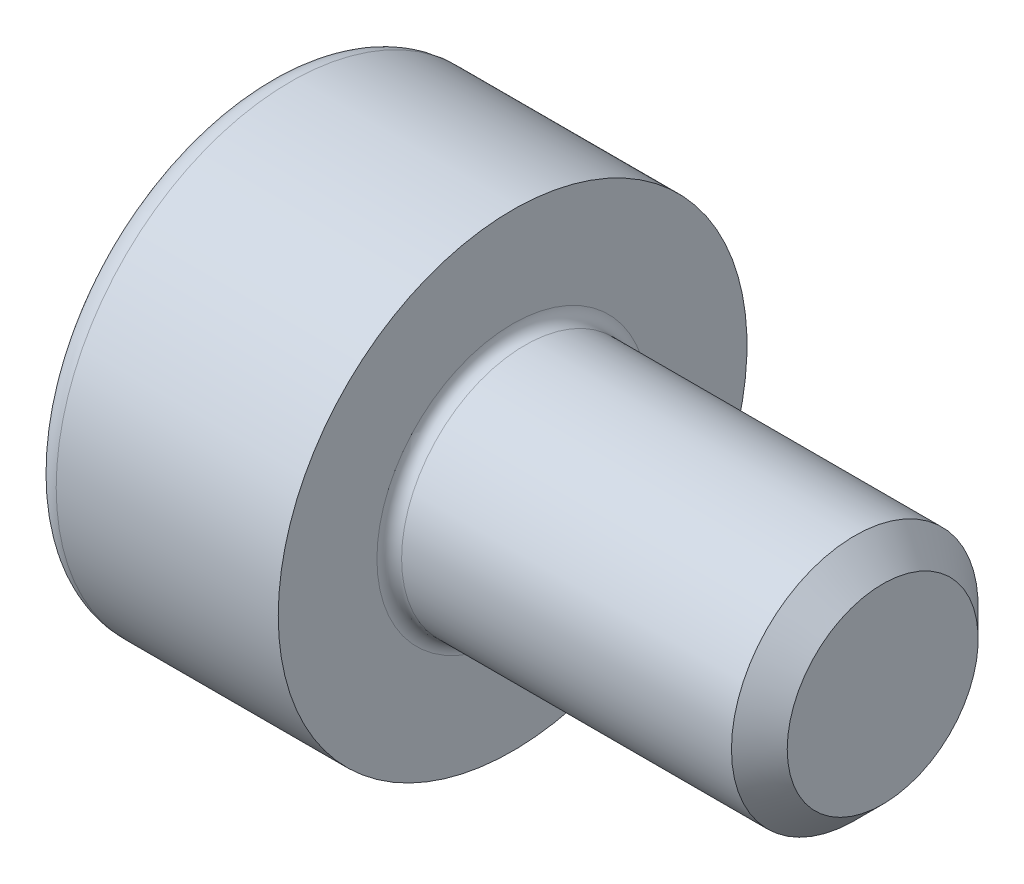
ISO-10303-21;
HEADER;
FILE_DESCRIPTION(('STEP AP214'),'2;1');
FILE_NAME('part.step','',(''),(''),'','','');
FILE_SCHEMA(('AUTOMOTIVE_DESIGN { 1 0 10303 214 1 1 1 1 }'));
ENDSEC;
DATA;
#1=APPLICATION_CONTEXT('core data for automotive mechanical design processes');
#2=APPLICATION_PROTOCOL_DEFINITION('international standard','automotive_design',2000,#1);
#3=PRODUCT_CONTEXT('',#1,'mechanical');
#4=PRODUCT('Part','Part','',(#3));
#5=PRODUCT_RELATED_PRODUCT_CATEGORY('part','',(#4));
#6=PRODUCT_DEFINITION_FORMATION('','',#4);
#7=PRODUCT_DEFINITION_CONTEXT('part definition',#1,'design');
#8=PRODUCT_DEFINITION('design','',#6,#7);
#9=PRODUCT_DEFINITION_SHAPE('','',#8);
#10=(LENGTH_UNIT() NAMED_UNIT(*) SI_UNIT(.MILLI.,.METRE.));
#11=(NAMED_UNIT(*) PLANE_ANGLE_UNIT() SI_UNIT($,.RADIAN.));
#12=(NAMED_UNIT(*) SI_UNIT($,.STERADIAN.) SOLID_ANGLE_UNIT());
#13=UNCERTAINTY_MEASURE_WITH_UNIT(LENGTH_MEASURE(1.E-05),#10,'distance_accuracy_value','');
#14=(GEOMETRIC_REPRESENTATION_CONTEXT(3) GLOBAL_UNCERTAINTY_ASSIGNED_CONTEXT((#13)) GLOBAL_UNIT_ASSIGNED_CONTEXT((#10,
#11,#12)) REPRESENTATION_CONTEXT('',''));
#15=CARTESIAN_POINT('',(0.,0.,0.));
#16=DIRECTION('',(0.,0.,1.));
#17=DIRECTION('',(1.,0.,0.));
#18=AXIS2_PLACEMENT_3D('',#15,#16,#17);
#19=CARTESIAN_POINT('',(5.,0.774,0.));
#20=DIRECTION('',(1.,0.,0.));
#21=DIRECTION('',(0.,0.,-1.));
#22=AXIS2_PLACEMENT_3D('',#19,#20,#21);
#23=PLANE('',#22);
#24=CARTESIAN_POINT('',(4.99999999993861,0.,0.));
#25=DIRECTION('',(-1.,0.,0.));
#26=DIRECTION('',(0.,0.,1.));
#27=AXIS2_PLACEMENT_3D('',#24,#25,#26);
#28=CIRCLE('',#27,0.773999999978514);
#29=CARTESIAN_POINT('',(4.99999999993861,0.,0.773999999978514));
#30=VERTEX_POINT('',#29);
#31=EDGE_CURVE('E107',#30,#30,#28,.T.);
#32=ORIENTED_EDGE('',*,*,#31,.F.);
#33=EDGE_LOOP('',(#32));
#34=FACE_BOUND('',#33,.T.);
#35=ADVANCED_FACE('F16',(#34),#23,.T.);
#36=CARTESIAN_POINT('',(0.999999999976353,0.,0.));
#37=DIRECTION('',(-1.,0.,0.));
#38=DIRECTION('',(0.,0.,1.));
#39=AXIS2_PLACEMENT_3D('',#36,#37,#38);
#40=CONICAL_SURFACE('',#39,0.760000000013861,1.04719755119142);
#41=CARTESIAN_POINT('',(1.43878620457372,0.,0.));
#42=VERTEX_POINT('',#41);
#43=VERTEX_LOOP('',#42);
#44=FACE_BOUND('',#43,.T.);
#45=CARTESIAN_POINT('',(0.999999999976353,0.,0.));
#46=DIRECTION('',(-1.,0.,0.));
#47=DIRECTION('',(0.,0.,1.));
#48=AXIS2_PLACEMENT_3D('',#45,#46,#47);
#49=CIRCLE('',#48,0.760000000013861);
#50=CARTESIAN_POINT('',(0.999999999988177,-0.658179306882177,0.380000000003467));
#51=VERTEX_POINT('',#50);
#52=CARTESIAN_POINT('',(0.999999999988177,0.,0.76000000000693));
#53=VERTEX_POINT('',#52);
#54=EDGE_CURVE('E96',#51,#53,#49,.T.);
#55=ORIENTED_EDGE('',*,*,#54,.T.);
#56=CARTESIAN_POINT('',(0.999999999976353,0.,0.));
#57=DIRECTION('',(-1.,0.,0.));
#58=DIRECTION('',(0.,0.,1.));
#59=AXIS2_PLACEMENT_3D('',#56,#57,#58);
#60=CIRCLE('',#59,0.760000000013861);
#61=CARTESIAN_POINT('',(0.999999999988177,0.658179306882173,0.380000000003464));
#62=VERTEX_POINT('',#61);
#63=EDGE_CURVE('E99',#53,#62,#60,.T.);
#64=ORIENTED_EDGE('',*,*,#63,.T.);
#65=CARTESIAN_POINT('',(0.999999999976353,0.,0.));
#66=DIRECTION('',(-1.,0.,0.));
#67=DIRECTION('',(0.,0.,1.));
#68=AXIS2_PLACEMENT_3D('',#65,#66,#67);
#69=CIRCLE('',#68,0.760000000013861);
#70=CARTESIAN_POINT('',(0.999999999988177,0.658179306882173,-0.380000000003465));
#71=VERTEX_POINT('',#70);
#72=EDGE_CURVE('E102',#62,#71,#69,.T.);
#73=ORIENTED_EDGE('',*,*,#72,.T.);
#74=CARTESIAN_POINT('',(0.999999999976353,0.,0.));
#75=DIRECTION('',(-1.,0.,0.));
#76=DIRECTION('',(0.,0.,1.));
#77=AXIS2_PLACEMENT_3D('',#74,#75,#76);
#78=CIRCLE('',#77,0.760000000013861);
#79=CARTESIAN_POINT('',(0.999999999988177,2.50354045686177E-13,-0.760000000006931));
#80=VERTEX_POINT('',#79);
#81=EDGE_CURVE('E117',#71,#80,#78,.T.);
#82=ORIENTED_EDGE('',*,*,#81,.T.);
#83=CARTESIAN_POINT('',(0.999999999976353,0.,0.));
#84=DIRECTION('',(-1.,0.,0.));
#85=DIRECTION('',(0.,0.,1.));
#86=AXIS2_PLACEMENT_3D('',#83,#84,#85);
#87=CIRCLE('',#86,0.760000000013861);
#88=CARTESIAN_POINT('',(0.999999999988177,-0.658179306882178,-0.380000000003466));
#89=VERTEX_POINT('',#88);
#90=EDGE_CURVE('E118',#80,#89,#87,.T.);
#91=ORIENTED_EDGE('',*,*,#90,.T.);
#92=CARTESIAN_POINT('',(0.999999999976353,0.,0.));
#93=DIRECTION('',(-1.,0.,0.));
#94=DIRECTION('',(0.,0.,1.));
#95=AXIS2_PLACEMENT_3D('',#92,#93,#94);
#96=CIRCLE('',#95,0.760000000013861);
#97=EDGE_CURVE('E225',#89,#51,#96,.T.);
#98=ORIENTED_EDGE('',*,*,#97,.T.);
#99=EDGE_LOOP('',(#55,#64,#73,#82,#91,#98));
#100=FACE_BOUND('',#99,.T.);
#101=ADVANCED_FACE('F101',(#44,#100),#40,.F.);
#102=CARTESIAN_POINT('',(4.77399999994077,0.,0.));
#103=DIRECTION('',(-1.,0.,0.));
#104=DIRECTION('',(0.,0.,1.));
#105=AXIS2_PLACEMENT_3D('',#102,#103,#104);
#106=CONICAL_SURFACE('',#105,0.999999999976353,0.785398163397448);
#107=CARTESIAN_POINT('',(4.774,0.,0.));
#108=DIRECTION('',(-1.,0.,0.));
#109=DIRECTION('',(0.,0.,1.));
#110=AXIS2_PLACEMENT_3D('',#107,#108,#109);
#111=CIRCLE('',#110,1.);
#112=CARTESIAN_POINT('',(4.774,0.,1.));
#113=VERTEX_POINT('',#112);
#114=EDGE_CURVE('E132',#113,#113,#111,.T.);
#115=ORIENTED_EDGE('',*,*,#114,.F.);
#116=EDGE_LOOP('',(#115));
#117=FACE_BOUND('',#116,.T.);
#118=ORIENTED_EDGE('',*,*,#31,.T.);
#119=EDGE_LOOP('',(#118));
#120=FACE_BOUND('',#119,.T.);
#121=ADVANCED_FACE('F515',(#117,#120),#106,.T.);
#122=CARTESIAN_POINT('',(1.,0.877572409168226,0.));
#123=DIRECTION('',(1.,0.,0.));
#124=DIRECTION('',(0.,0.,-1.));
#125=AXIS2_PLACEMENT_3D('',#122,#123,#124);
#126=PLANE('',#125);
#127=DIRECTION('',(0.,0.5,-0.866025403784439));
#128=VECTOR('',#127,1.);
#129=CARTESIAN_POINT('',(1.,0.877572409168226,0.));
#130=LINE('',#129,#128);
#131=CARTESIAN_POINT('',(1.,0.43878620458411,0.759999999999999));
#132=VERTEX_POINT('',#131);
#133=EDGE_CURVE('E121',#62,#132,#130,.F.);
#134=ORIENTED_EDGE('',*,*,#133,.F.);
#135=ORIENTED_EDGE('',*,*,#63,.F.);
#136=DIRECTION('',(0.,-1.,0.));
#137=VECTOR('',#136,1.);
#138=CARTESIAN_POINT('',(1.,-0.438786204584121,0.76));
#139=LINE('',#138,#137);
#140=EDGE_CURVE('E123',#53,#132,#139,.F.);
#141=ORIENTED_EDGE('',*,*,#140,.T.);
#142=EDGE_LOOP('',(#134,#135,#141));
#143=FACE_BOUND('',#142,.T.);
#144=ADVANCED_FACE('F122',(#143),#126,.F.);
#145=CARTESIAN_POINT('',(1.,0.877572409168226,0.));
#146=DIRECTION('',(1.,0.,0.));
#147=DIRECTION('',(0.,0.,-1.));
#148=AXIS2_PLACEMENT_3D('',#145,#146,#147);
#149=PLANE('',#148);
#150=DIRECTION('',(0.,-1.,0.));
#151=VECTOR('',#150,1.);
#152=CARTESIAN_POINT('',(1.,-0.438786204584121,0.76));
#153=LINE('',#152,#151);
#154=CARTESIAN_POINT('',(1.,-0.438786204584121,0.76));
#155=VERTEX_POINT('',#154);
#156=EDGE_CURVE('E127',#155,#53,#153,.F.);
#157=ORIENTED_EDGE('',*,*,#156,.T.);
#158=ORIENTED_EDGE('',*,*,#54,.F.);
#159=DIRECTION('',(0.,0.500000000000001,0.866025403784438));
#160=VECTOR('',#159,1.);
#161=CARTESIAN_POINT('',(1.,-0.438786204584121,0.76));
#162=LINE('',#161,#160);
#163=EDGE_CURVE('E182',#155,#51,#162,.F.);
#164=ORIENTED_EDGE('',*,*,#163,.F.);
#165=EDGE_LOOP('',(#157,#158,#164));
#166=FACE_BOUND('',#165,.T.);
#167=ADVANCED_FACE('F371',(#166),#149,.F.);
#168=CARTESIAN_POINT('',(1.,0.877572409168226,0.));
#169=DIRECTION('',(1.,0.,0.));
#170=DIRECTION('',(0.,0.,-1.));
#171=AXIS2_PLACEMENT_3D('',#168,#169,#170);
#172=PLANE('',#171);
#173=DIRECTION('',(0.,0.500000000000001,0.866025403784438));
#174=VECTOR('',#173,1.);
#175=CARTESIAN_POINT('',(1.,-0.438786204584121,0.76));
#176=LINE('',#175,#174);
#177=CARTESIAN_POINT('',(1.,-0.877572409168238,0.));
#178=VERTEX_POINT('',#177);
#179=EDGE_CURVE('E178',#51,#178,#176,.F.);
#180=ORIENTED_EDGE('',*,*,#179,.F.);
#181=ORIENTED_EDGE('',*,*,#97,.F.);
#182=DIRECTION('',(0.,-0.5,0.866025403784439));
#183=VECTOR('',#182,1.);
#184=CARTESIAN_POINT('',(1.,-0.877572409168238,0.));
#185=LINE('',#184,#183);
#186=EDGE_CURVE('E164',#178,#89,#185,.F.);
#187=ORIENTED_EDGE('',*,*,#186,.F.);
#188=EDGE_LOOP('',(#180,#181,#187));
#189=FACE_BOUND('',#188,.T.);
#190=ADVANCED_FACE('F366',(#189),#172,.F.);
#191=CARTESIAN_POINT('',(1.,0.877572409168226,0.));
#192=DIRECTION('',(1.,0.,0.));
#193=DIRECTION('',(0.,0.,-1.));
#194=AXIS2_PLACEMENT_3D('',#191,#192,#193);
#195=PLANE('',#194);
#196=DIRECTION('',(0.,-0.5,0.866025403784439));
#197=VECTOR('',#196,1.);
#198=CARTESIAN_POINT('',(1.,-0.877572409168238,0.));
#199=LINE('',#198,#197);
#200=CARTESIAN_POINT('',(1.,-0.438786204584122,-0.76));
#201=VERTEX_POINT('',#200);
#202=EDGE_CURVE('E161',#89,#201,#199,.F.);
#203=ORIENTED_EDGE('',*,*,#202,.F.);
#204=ORIENTED_EDGE('',*,*,#90,.F.);
#205=DIRECTION('',(0.,1.,0.));
#206=VECTOR('',#205,1.);
#207=CARTESIAN_POINT('',(1.,0.438786204584109,-0.760000000000001));
#208=LINE('',#207,#206);
#209=EDGE_CURVE('E155',#80,#201,#208,.F.);
#210=ORIENTED_EDGE('',*,*,#209,.T.);
#211=EDGE_LOOP('',(#203,#204,#210));
#212=FACE_BOUND('',#211,.T.);
#213=ADVANCED_FACE('F361',(#212),#195,.F.);
#214=CARTESIAN_POINT('',(1.,0.877572409168226,0.));
#215=DIRECTION('',(1.,0.,0.));
#216=DIRECTION('',(0.,0.,-1.));
#217=AXIS2_PLACEMENT_3D('',#214,#215,#216);
#218=PLANE('',#217);
#219=DIRECTION('',(0.,0.500000000000001,0.866025403784438));
#220=VECTOR('',#219,1.);
#221=CARTESIAN_POINT('',(1.,0.877572409168226,0.));
#222=LINE('',#221,#220);
#223=CARTESIAN_POINT('',(1.,0.877572409168226,0.));
#224=VERTEX_POINT('',#223);
#225=EDGE_CURVE('E115',#224,#71,#222,.F.);
#226=ORIENTED_EDGE('',*,*,#225,.T.);
#227=ORIENTED_EDGE('',*,*,#72,.F.);
#228=DIRECTION('',(0.,0.5,-0.866025403784439));
#229=VECTOR('',#228,1.);
#230=CARTESIAN_POINT('',(1.,0.877572409168226,0.));
#231=LINE('',#230,#229);
#232=EDGE_CURVE('E112',#224,#62,#231,.F.);
#233=ORIENTED_EDGE('',*,*,#232,.F.);
#234=EDGE_LOOP('',(#226,#227,#233));
#235=FACE_BOUND('',#234,.T.);
#236=ADVANCED_FACE('F110',(#235),#218,.F.);
#237=CARTESIAN_POINT('',(1.,0.877572409168226,0.));
#238=DIRECTION('',(1.,0.,0.));
#239=DIRECTION('',(0.,0.,-1.));
#240=AXIS2_PLACEMENT_3D('',#237,#238,#239);
#241=PLANE('',#240);
#242=DIRECTION('',(0.,1.,0.));
#243=VECTOR('',#242,1.);
#244=CARTESIAN_POINT('',(1.,0.438786204584109,-0.760000000000001));
#245=LINE('',#244,#243);
#246=CARTESIAN_POINT('',(1.,0.438786204584109,-0.760000000000001));
#247=VERTEX_POINT('',#246);
#248=EDGE_CURVE('E158',#247,#80,#245,.F.);
#249=ORIENTED_EDGE('',*,*,#248,.T.);
#250=ORIENTED_EDGE('',*,*,#81,.F.);
#251=DIRECTION('',(0.,0.500000000000001,0.866025403784438));
#252=VECTOR('',#251,1.);
#253=CARTESIAN_POINT('',(1.,0.877572409168226,0.));
#254=LINE('',#253,#252);
#255=EDGE_CURVE('E327',#71,#247,#254,.F.);
#256=ORIENTED_EDGE('',*,*,#255,.T.);
#257=EDGE_LOOP('',(#249,#250,#256));
#258=FACE_BOUND('',#257,.T.);
#259=ADVANCED_FACE('F470',(#258),#241,.F.);
#260=CARTESIAN_POINT('',(-31.75,0.,0.));
#261=DIRECTION('',(-1.,0.,0.));
#262=DIRECTION('',(0.,0.,1.));
#263=AXIS2_PLACEMENT_3D('',#260,#261,#262);
#264=CYLINDRICAL_SURFACE('',#263,1.);
#265=CARTESIAN_POINT('',(2.1,0.,0.));
#266=DIRECTION('',(1.,0.,0.));
#267=DIRECTION('',(0.,0.,-1.));
#268=AXIS2_PLACEMENT_3D('',#265,#266,#267);
#269=CIRCLE('',#268,1.);
#270=CARTESIAN_POINT('',(2.1,0.,-1.));
#271=VERTEX_POINT('',#270);
#272=EDGE_CURVE('E146',#271,#271,#269,.T.);
#273=ORIENTED_EDGE('',*,*,#272,.T.);
#274=EDGE_LOOP('',(#273));
#275=FACE_BOUND('',#274,.T.);
#276=ORIENTED_EDGE('',*,*,#114,.T.);
#277=EDGE_LOOP('',(#276));
#278=FACE_BOUND('',#277,.T.);
#279=ADVANCED_FACE('F383',(#275,#278),#264,.T.);
#280=CARTESIAN_POINT('',(1.,0.877572409168226,0.));
#281=DIRECTION('',(0.,-0.866025403784439,-0.5));
#282=DIRECTION('',(0.,0.5,-0.866025403784439));
#283=AXIS2_PLACEMENT_3D('',#280,#281,#282);
#284=PLANE('',#283);
#285=ORIENTED_EDGE('',*,*,#133,.T.);
#286=DIRECTION('',(1.,0.,0.));
#287=VECTOR('',#286,1.);
#288=CARTESIAN_POINT('',(1.,0.43878620458411,0.759999999999999));
#289=LINE('',#288,#287);
#290=CARTESIAN_POINT('',(0.,0.43878620458411,0.759999999999999));
#291=VERTEX_POINT('',#290);
#292=EDGE_CURVE('E202',#132,#291,#289,.F.);
#293=ORIENTED_EDGE('',*,*,#292,.T.);
#294=DIRECTION('',(0.,-0.5,0.866025403784439));
#295=VECTOR('',#294,1.);
#296=CARTESIAN_POINT('',(0.,0.877572409168226,0.));
#297=LINE('',#296,#295);
#298=CARTESIAN_POINT('',(0.,0.877572409168226,0.));
#299=VERTEX_POINT('',#298);
#300=EDGE_CURVE('E142',#299,#291,#297,.T.);
#301=ORIENTED_EDGE('',*,*,#300,.F.);
#302=DIRECTION('',(1.,0.,0.));
#303=VECTOR('',#302,1.);
#304=CARTESIAN_POINT('',(1.,0.877572409168226,0.));
#305=LINE('',#304,#303);
#306=EDGE_CURVE('E131',#299,#224,#305,.T.);
#307=ORIENTED_EDGE('',*,*,#306,.T.);
#308=ORIENTED_EDGE('',*,*,#232,.T.);
#309=EDGE_LOOP('',(#285,#293,#301,#307,#308));
#310=FACE_BOUND('',#309,.T.);
#311=ADVANCED_FACE('F129',(#310),#284,.T.);
#312=CARTESIAN_POINT('',(1.,-0.438786204584121,0.76));
#313=DIRECTION('',(0.,0.,1.));
#314=DIRECTION('',(0.,-1.,0.));
#315=AXIS2_PLACEMENT_3D('',#312,#313,#314);
#316=PLANE('',#315);
#317=ORIENTED_EDGE('',*,*,#292,.F.);
#318=ORIENTED_EDGE('',*,*,#140,.F.);
#319=ORIENTED_EDGE('',*,*,#156,.F.);
#320=DIRECTION('',(1.,0.,0.));
#321=VECTOR('',#320,1.);
#322=CARTESIAN_POINT('',(1.,-0.438786204584121,0.76));
#323=LINE('',#322,#321);
#324=CARTESIAN_POINT('',(0.,-0.438786204584121,0.76));
#325=VERTEX_POINT('',#324);
#326=EDGE_CURVE('E197',#325,#155,#323,.T.);
#327=ORIENTED_EDGE('',*,*,#326,.F.);
#328=DIRECTION('',(0.,1.,0.));
#329=VECTOR('',#328,1.);
#330=CARTESIAN_POINT('',(0.,0.,0.759999999999999));
#331=LINE('',#330,#329);
#332=EDGE_CURVE('E145',#291,#325,#331,.F.);
#333=ORIENTED_EDGE('',*,*,#332,.F.);
#334=EDGE_LOOP('',(#317,#318,#319,#327,#333));
#335=FACE_BOUND('',#334,.T.);
#336=ADVANCED_FACE('F373',(#335),#316,.F.);
#337=CARTESIAN_POINT('',(1.,-0.438786204584121,0.76));
#338=DIRECTION('',(0.,0.866025403784438,-0.500000000000001));
#339=DIRECTION('',(0.,0.500000000000001,0.866025403784438));
#340=AXIS2_PLACEMENT_3D('',#337,#338,#339);
#341=PLANE('',#340);
#342=ORIENTED_EDGE('',*,*,#179,.T.);
#343=DIRECTION('',(1.,0.,0.));
#344=VECTOR('',#343,1.);
#345=CARTESIAN_POINT('',(1.,-0.877572409168238,0.));
#346=LINE('',#345,#344);
#347=CARTESIAN_POINT('',(0.,-0.877572409168238,0.));
#348=VERTEX_POINT('',#347);
#349=EDGE_CURVE('E173',#348,#178,#346,.T.);
#350=ORIENTED_EDGE('',*,*,#349,.F.);
#351=DIRECTION('',(0.,-0.500000000000001,-0.866025403784438));
#352=VECTOR('',#351,1.);
#353=CARTESIAN_POINT('',(0.,-0.438786204584121,0.76));
#354=LINE('',#353,#352);
#355=EDGE_CURVE('E188',#325,#348,#354,.T.);
#356=ORIENTED_EDGE('',*,*,#355,.F.);
#357=ORIENTED_EDGE('',*,*,#326,.T.);
#358=ORIENTED_EDGE('',*,*,#163,.T.);
#359=EDGE_LOOP('',(#342,#350,#356,#357,#358));
#360=FACE_BOUND('',#359,.T.);
#361=ADVANCED_FACE('F369',(#360),#341,.T.);
#362=CARTESIAN_POINT('',(1.,-0.877572409168238,0.));
#363=DIRECTION('',(0.,0.866025403784439,0.5));
#364=DIRECTION('',(0.,-0.5,0.866025403784439));
#365=AXIS2_PLACEMENT_3D('',#362,#363,#364);
#366=PLANE('',#365);
#367=ORIENTED_EDGE('',*,*,#202,.T.);
#368=DIRECTION('',(1.,0.,0.));
#369=VECTOR('',#368,1.);
#370=CARTESIAN_POINT('',(1.,-0.438786204584122,-0.76));
#371=LINE('',#370,#369);
#372=CARTESIAN_POINT('',(0.,-0.438786204584122,-0.76));
#373=VERTEX_POINT('',#372);
#374=EDGE_CURVE('E157',#201,#373,#371,.F.);
#375=ORIENTED_EDGE('',*,*,#374,.T.);
#376=DIRECTION('',(0.,0.5,-0.866025403784439));
#377=VECTOR('',#376,1.);
#378=CARTESIAN_POINT('',(0.,-0.877572409168238,0.));
#379=LINE('',#378,#377);
#380=EDGE_CURVE('E185',#348,#373,#379,.T.);
#381=ORIENTED_EDGE('',*,*,#380,.F.);
#382=ORIENTED_EDGE('',*,*,#349,.T.);
#383=ORIENTED_EDGE('',*,*,#186,.T.);
#384=EDGE_LOOP('',(#367,#375,#381,#382,#383));
#385=FACE_BOUND('',#384,.T.);
#386=ADVANCED_FACE('F357',(#385),#366,.T.);
#387=CARTESIAN_POINT('',(1.,0.438786204584109,-0.760000000000001));
#388=DIRECTION('',(0.,0.,-1.));
#389=DIRECTION('',(0.,1.,0.));
#390=AXIS2_PLACEMENT_3D('',#387,#388,#389);
#391=PLANE('',#390);
#392=ORIENTED_EDGE('',*,*,#374,.F.);
#393=ORIENTED_EDGE('',*,*,#209,.F.);
#394=ORIENTED_EDGE('',*,*,#248,.F.);
#395=DIRECTION('',(1.,0.,0.));
#396=VECTOR('',#395,1.);
#397=CARTESIAN_POINT('',(1.,0.438786204584109,-0.760000000000001));
#398=LINE('',#397,#396);
#399=CARTESIAN_POINT('',(0.,0.438786204584109,-0.760000000000001));
#400=VERTEX_POINT('',#399);
#401=EDGE_CURVE('E325',#247,#400,#398,.F.);
#402=ORIENTED_EDGE('',*,*,#401,.T.);
#403=DIRECTION('',(0.,1.,0.));
#404=VECTOR('',#403,1.);
#405=CARTESIAN_POINT('',(0.,0.,-0.76));
#406=LINE('',#405,#404);
#407=EDGE_CURVE('E152',#373,#400,#406,.T.);
#408=ORIENTED_EDGE('',*,*,#407,.F.);
#409=EDGE_LOOP('',(#392,#393,#394,#402,#408));
#410=FACE_BOUND('',#409,.T.);
#411=ADVANCED_FACE('F346',(#410),#391,.F.);
#412=CARTESIAN_POINT('',(1.,0.877572409168226,0.));
#413=DIRECTION('',(0.,0.866025403784438,-0.500000000000001));
#414=DIRECTION('',(0.,0.500000000000001,0.866025403784438));
#415=AXIS2_PLACEMENT_3D('',#412,#413,#414);
#416=PLANE('',#415);
#417=ORIENTED_EDGE('',*,*,#401,.F.);
#418=ORIENTED_EDGE('',*,*,#255,.F.);
#419=ORIENTED_EDGE('',*,*,#225,.F.);
#420=ORIENTED_EDGE('',*,*,#306,.F.);
#421=DIRECTION('',(0.,0.500000000000001,0.866025403784438));
#422=VECTOR('',#421,1.);
#423=CARTESIAN_POINT('',(0.,0.438786204584109,-0.760000000000001));
#424=LINE('',#423,#422);
#425=EDGE_CURVE('E149',#400,#299,#424,.T.);
#426=ORIENTED_EDGE('',*,*,#425,.F.);
#427=EDGE_LOOP('',(#417,#418,#419,#420,#426));
#428=FACE_BOUND('',#427,.T.);
#429=ADVANCED_FACE('F351',(#428),#416,.F.);
#430=CARTESIAN_POINT('',(2.1,0.,0.));
#431=DIRECTION('',(1.,0.,0.));
#432=DIRECTION('',(0.,0.,-1.));
#433=AXIS2_PLACEMENT_3D('',#430,#431,#432);
#434=TOROIDAL_SURFACE('',#433,1.1,0.1);
#435=ORIENTED_EDGE('',*,*,#272,.F.);
#436=EDGE_LOOP('',(#435));
#437=FACE_BOUND('',#436,.T.);
#438=CARTESIAN_POINT('',(2.,0.,0.));
#439=DIRECTION('',(1.,0.,0.));
#440=DIRECTION('',(0.,0.,1.));
#441=AXIS2_PLACEMENT_3D('',#438,#439,#440);
#442=CIRCLE('',#441,1.1);
#443=CARTESIAN_POINT('',(2.,0.,-1.1));
#444=VERTEX_POINT('',#443);
#445=CARTESIAN_POINT('',(2.,0.,1.1));
#446=VERTEX_POINT('',#445);
#447=EDGE_CURVE('E258',#444,#446,#442,.F.);
#448=ORIENTED_EDGE('',*,*,#447,.F.);
#449=CARTESIAN_POINT('',(2.,0.,0.));
#450=DIRECTION('',(1.,0.,0.));
#451=DIRECTION('',(0.,0.,-1.));
#452=AXIS2_PLACEMENT_3D('',#449,#450,#451);
#453=CIRCLE('',#452,1.1);
#454=EDGE_CURVE('E268',#446,#444,#453,.F.);
#455=ORIENTED_EDGE('',*,*,#454,.F.);
#456=EDGE_LOOP('',(#448,#455));
#457=FACE_BOUND('',#456,.T.);
#458=ADVANCED_FACE('F289',(#437,#457),#434,.F.);
#459=CARTESIAN_POINT('',(0.,0.,0.));
#460=DIRECTION('',(-1.,0.,0.));
#461=DIRECTION('',(0.,0.,1.));
#462=AXIS2_PLACEMENT_3D('',#459,#460,#461);
#463=PLANE('',#462);
#464=CARTESIAN_POINT('',(0.,0.,0.));
#465=DIRECTION('',(1.,0.,0.));
#466=DIRECTION('',(0.,0.,-1.));
#467=AXIS2_PLACEMENT_3D('',#464,#465,#466);
#468=CIRCLE('',#467,1.7);
#469=CARTESIAN_POINT('',(0.,0.,-1.7));
#470=VERTEX_POINT('',#469);
#471=CARTESIAN_POINT('',(0.,0.,1.7));
#472=VERTEX_POINT('',#471);
#473=EDGE_CURVE('E222',#470,#472,#468,.T.);
#474=ORIENTED_EDGE('',*,*,#473,.F.);
#475=CARTESIAN_POINT('',(0.,0.,0.));
#476=DIRECTION('',(1.,0.,0.));
#477=DIRECTION('',(0.,0.,1.));
#478=AXIS2_PLACEMENT_3D('',#475,#476,#477);
#479=CIRCLE('',#478,1.7);
#480=EDGE_CURVE('E35',#472,#470,#479,.T.);
#481=ORIENTED_EDGE('',*,*,#480,.F.);
#482=EDGE_LOOP('',(#474,#481));
#483=FACE_BOUND('',#482,.T.);
#484=ORIENTED_EDGE('',*,*,#407,.T.);
#485=ORIENTED_EDGE('',*,*,#425,.T.);
#486=ORIENTED_EDGE('',*,*,#300,.T.);
#487=ORIENTED_EDGE('',*,*,#332,.T.);
#488=ORIENTED_EDGE('',*,*,#355,.T.);
#489=ORIENTED_EDGE('',*,*,#380,.T.);
#490=EDGE_LOOP('',(#484,#485,#486,#487,#488,#489));
#491=FACE_BOUND('',#490,.T.);
#492=ADVANCED_FACE('F281',(#483,#491),#463,.T.);
#493=CARTESIAN_POINT('',(2.,1.9,0.));
#494=DIRECTION('',(1.,0.,0.));
#495=DIRECTION('',(0.,0.,-1.));
#496=AXIS2_PLACEMENT_3D('',#493,#494,#495);
#497=PLANE('',#496);
#498=CARTESIAN_POINT('',(2.,0.,0.));
#499=DIRECTION('',(-1.,0.,0.));
#500=DIRECTION('',(0.,0.,1.));
#501=AXIS2_PLACEMENT_3D('',#498,#499,#500);
#502=CIRCLE('',#501,1.9);
#503=CARTESIAN_POINT('',(2.,0.,1.9));
#504=VERTEX_POINT('',#503);
#505=EDGE_CURVE('E27',#504,#504,#502,.T.);
#506=ORIENTED_EDGE('',*,*,#505,.F.);
#507=EDGE_LOOP('',(#506));
#508=FACE_BOUND('',#507,.T.);
#509=ORIENTED_EDGE('',*,*,#447,.T.);
#510=ORIENTED_EDGE('',*,*,#454,.T.);
#511=EDGE_LOOP('',(#509,#510));
#512=FACE_BOUND('',#511,.T.);
#513=ADVANCED_FACE('F247',(#508,#512),#497,.T.);
#514=CARTESIAN_POINT('',(0.199999999999999,0.,0.));
#515=DIRECTION('',(-1.,0.,0.));
#516=DIRECTION('',(0.,0.,1.));
#517=AXIS2_PLACEMENT_3D('',#514,#515,#516);
#518=TOROIDAL_SURFACE('',#517,1.7,0.2);
#519=ORIENTED_EDGE('',*,*,#480,.T.);
#520=ORIENTED_EDGE('',*,*,#473,.T.);
#521=EDGE_LOOP('',(#519,#520));
#522=FACE_BOUND('',#521,.T.);
#523=CARTESIAN_POINT('',(0.199999999999999,0.,0.));
#524=DIRECTION('',(-1.,0.,0.));
#525=DIRECTION('',(0.,0.,1.));
#526=AXIS2_PLACEMENT_3D('',#523,#524,#525);
#527=CIRCLE('',#526,1.9);
#528=CARTESIAN_POINT('',(0.199999999999999,0.,1.9));
#529=VERTEX_POINT('',#528);
#530=EDGE_CURVE('E11',#529,#529,#527,.F.);
#531=ORIENTED_EDGE('',*,*,#530,.F.);
#532=EDGE_LOOP('',(#531));
#533=FACE_BOUND('',#532,.T.);
#534=ADVANCED_FACE('F235',(#522,#533),#518,.T.);
#535=CARTESIAN_POINT('',(-31.75,0.,0.));
#536=DIRECTION('',(-1.,0.,0.));
#537=DIRECTION('',(0.,0.,1.));
#538=AXIS2_PLACEMENT_3D('',#535,#536,#537);
#539=CYLINDRICAL_SURFACE('',#538,1.9);
#540=ORIENTED_EDGE('',*,*,#530,.T.);
#541=EDGE_LOOP('',(#540));
#542=FACE_BOUND('',#541,.T.);
#543=ORIENTED_EDGE('',*,*,#505,.T.);
#544=EDGE_LOOP('',(#543));
#545=FACE_BOUND('',#544,.T.);
#546=ADVANCED_FACE('F246',(#542,#545),#539,.T.);
#547=CLOSED_SHELL('',(#35,#101,#121,#144,#167,#190,#213,#236,#259,#279,#311,#336,#361,#386,#411,
#429,#458,#492,#513,#534,#546));
#548=MANIFOLD_SOLID_BREP('B1',#547);
#549=ADVANCED_BREP_SHAPE_REPRESENTATION('',(#18,#548),#14);
#550=SHAPE_DEFINITION_REPRESENTATION(#9,#549);
ENDSEC;
END-ISO-10303-21;
